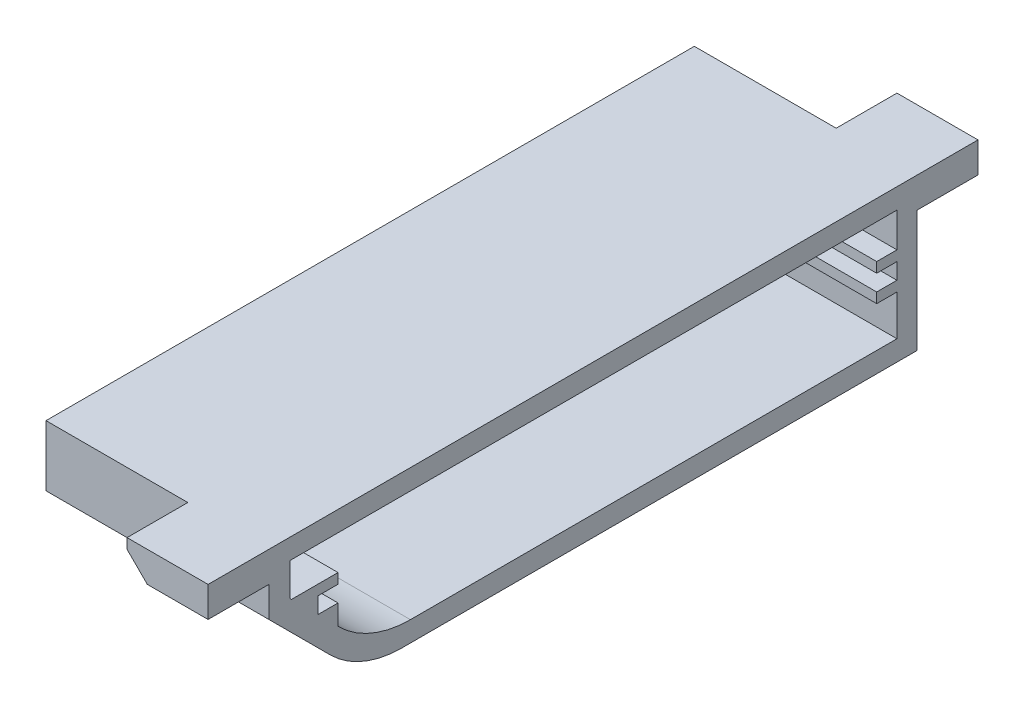
ISO-10303-21;
HEADER;
FILE_DESCRIPTION(('STEP AP214'),'2;1');
FILE_NAME('part.step','',(''),(''),'','','');
FILE_SCHEMA(('AUTOMOTIVE_DESIGN { 1 0 10303 214 1 1 1 1 }'));
ENDSEC;
DATA;
#1=APPLICATION_CONTEXT('core data for automotive mechanical design processes');
#2=APPLICATION_PROTOCOL_DEFINITION('international standard','automotive_design',2000,#1);
#3=PRODUCT_CONTEXT('',#1,'mechanical');
#4=PRODUCT('Part','Part','',(#3));
#5=PRODUCT_RELATED_PRODUCT_CATEGORY('part','',(#4));
#6=PRODUCT_DEFINITION_FORMATION('','',#4);
#7=PRODUCT_DEFINITION_CONTEXT('part definition',#1,'design');
#8=PRODUCT_DEFINITION('design','',#6,#7);
#9=PRODUCT_DEFINITION_SHAPE('','',#8);
#10=(LENGTH_UNIT() NAMED_UNIT(*) SI_UNIT(.MILLI.,.METRE.));
#11=(NAMED_UNIT(*) PLANE_ANGLE_UNIT() SI_UNIT($,.RADIAN.));
#12=(NAMED_UNIT(*) SI_UNIT($,.STERADIAN.) SOLID_ANGLE_UNIT());
#13=UNCERTAINTY_MEASURE_WITH_UNIT(LENGTH_MEASURE(1.E-05),#10,'distance_accuracy_value','');
#14=(GEOMETRIC_REPRESENTATION_CONTEXT(3) GLOBAL_UNCERTAINTY_ASSIGNED_CONTEXT((#13)) GLOBAL_UNIT_ASSIGNED_CONTEXT((#10,
#11,#12)) REPRESENTATION_CONTEXT('',''));
#15=CARTESIAN_POINT('',(0.,0.,0.));
#16=DIRECTION('',(0.,0.,1.));
#17=DIRECTION('',(1.,0.,0.));
#18=AXIS2_PLACEMENT_3D('',#15,#16,#17);
#19=CARTESIAN_POINT('',(0.,0.,2.));
#20=DIRECTION('',(0.,0.,-1.));
#21=DIRECTION('',(-1.,0.,0.));
#22=AXIS2_PLACEMENT_3D('',#19,#20,#21);
#23=PLANE('',#22);
#24=DIRECTION('',(0.,1.,0.));
#25=VECTOR('',#24,1.);
#26=CARTESIAN_POINT('',(22.,15.,2.));
#27=LINE('',#26,#25);
#28=CARTESIAN_POINT('',(22.,7.,2.));
#29=VERTEX_POINT('',#28);
#30=CARTESIAN_POINT('',(22.,8.6,2.));
#31=VERTEX_POINT('',#30);
#32=EDGE_CURVE('E482',#29,#31,#27,.T.);
#33=ORIENTED_EDGE('',*,*,#32,.T.);
#34=DIRECTION('',(-1.,0.,0.));
#35=VECTOR('',#34,1.);
#36=CARTESIAN_POINT('',(22.,8.6,2.));
#37=LINE('',#36,#35);
#38=CARTESIAN_POINT('',(0.,8.6,2.));
#39=VERTEX_POINT('',#38);
#40=EDGE_CURVE('E291',#31,#39,#37,.T.);
#41=ORIENTED_EDGE('',*,*,#40,.T.);
#42=DIRECTION('',(0.,-1.,0.));
#43=VECTOR('',#42,1.);
#44=CARTESIAN_POINT('',(0.,0.,2.));
#45=LINE('',#44,#43);
#46=CARTESIAN_POINT('',(0.,7.,2.));
#47=VERTEX_POINT('',#46);
#48=EDGE_CURVE('E477',#39,#47,#45,.T.);
#49=ORIENTED_EDGE('',*,*,#48,.T.);
#50=DIRECTION('',(-1.,0.,0.));
#51=VECTOR('',#50,1.);
#52=CARTESIAN_POINT('',(22.,7.,2.));
#53=LINE('',#52,#51);
#54=EDGE_CURVE('E325',#29,#47,#53,.T.);
#55=ORIENTED_EDGE('',*,*,#54,.F.);
#56=EDGE_LOOP('',(#33,#41,#49,#55));
#57=FACE_BOUND('',#56,.T.);
#58=ADVANCED_FACE('F39',(#57),#23,.F.);
#59=CARTESIAN_POINT('',(0.,13.,2.));
#60=VERTEX_POINT('',#59);
#61=CARTESIAN_POINT('',(0.,9.6,2.));
#62=VERTEX_POINT('',#61);
#63=EDGE_CURVE('E474',#60,#62,#45,.T.);
#64=ORIENTED_EDGE('',*,*,#63,.T.);
#65=DIRECTION('',(-1.,0.,0.));
#66=VECTOR('',#65,1.);
#67=CARTESIAN_POINT('',(22.,9.6,2.));
#68=LINE('',#67,#66);
#69=CARTESIAN_POINT('',(22.,9.6,2.));
#70=VERTEX_POINT('',#69);
#71=EDGE_CURVE('E303',#70,#62,#68,.T.);
#72=ORIENTED_EDGE('',*,*,#71,.F.);
#73=CARTESIAN_POINT('',(22.,13.,2.));
#74=VERTEX_POINT('',#73);
#75=EDGE_CURVE('E476',#70,#74,#27,.T.);
#76=ORIENTED_EDGE('',*,*,#75,.T.);
#77=DIRECTION('',(1.,0.,0.));
#78=VECTOR('',#77,1.);
#79=CARTESIAN_POINT('',(0.,13.,2.));
#80=LINE('',#79,#78);
#81=EDGE_CURVE('E455',#60,#74,#80,.T.);
#82=ORIENTED_EDGE('',*,*,#81,.F.);
#83=EDGE_LOOP('',(#64,#72,#76,#82));
#84=FACE_BOUND('',#83,.T.);
#85=ADVANCED_FACE('F589',(#84),#23,.F.);
#86=CARTESIAN_POINT('',(22.,-26.085786437627,26.0857864376276));
#87=DIRECTION('',(0.,0.70710678118654,-0.707106781186555));
#88=DIRECTION('',(0.,0.707106781186555,0.70710678118654));
#89=AXIS2_PLACEMENT_3D('',#86,#87,#88);
#90=PLANE('',#89);
#91=DIRECTION('',(0.,-0.707106781186555,-0.70710678118654));
#92=VECTOR('',#91,1.);
#93=CARTESIAN_POINT('',(22.,-26.085786437627,26.0857864376276));
#94=LINE('',#93,#92);
#95=CARTESIAN_POINT('',(22.,4.99999999999995,57.1715728752539));
#96=VERTEX_POINT('',#95);
#97=CARTESIAN_POINT('',(22.,4.92893218813461,57.1005050633885));
#98=VERTEX_POINT('',#97);
#99=EDGE_CURVE('E431',#96,#98,#94,.T.);
#100=ORIENTED_EDGE('',*,*,#99,.T.);
#101=DIRECTION('',(-1.,0.,0.));
#102=VECTOR('',#101,1.);
#103=CARTESIAN_POINT('',(22.,4.9289321881346,57.1005050633885));
#104=LINE('',#103,#102);
#105=CARTESIAN_POINT('',(0.,4.92893218813461,57.1005050633885));
#106=VERTEX_POINT('',#105);
#107=EDGE_CURVE('E519',#98,#106,#104,.T.);
#108=ORIENTED_EDGE('',*,*,#107,.T.);
#109=DIRECTION('',(0.,-0.707106781186555,-0.70710678118654));
#110=VECTOR('',#109,1.);
#111=CARTESIAN_POINT('',(0.,-26.085786437627,26.0857864376276));
#112=LINE('',#111,#110);
#113=CARTESIAN_POINT('',(0.,4.99999999999995,57.1715728752538));
#114=VERTEX_POINT('',#113);
#115=EDGE_CURVE('E426',#114,#106,#112,.T.);
#116=ORIENTED_EDGE('',*,*,#115,.F.);
#117=DIRECTION('',(-1.,0.,0.));
#118=VECTOR('',#117,1.);
#119=CARTESIAN_POINT('',(22.,4.99999999999995,57.1715728752539));
#120=LINE('',#119,#118);
#121=EDGE_CURVE('E368',#96,#114,#120,.T.);
#122=ORIENTED_EDGE('',*,*,#121,.F.);
#123=EDGE_LOOP('',(#100,#108,#116,#122));
#124=FACE_BOUND('',#123,.T.);
#125=ADVANCED_FACE('F551',(#124),#90,.T.);
#126=CARTESIAN_POINT('',(22.,0.,64.));
#127=DIRECTION('',(0.,0.,-1.));
#128=DIRECTION('',(-1.,0.,0.));
#129=AXIS2_PLACEMENT_3D('',#126,#127,#128);
#130=PLANE('',#129);
#131=DIRECTION('',(1.,0.,0.));
#132=VECTOR('',#131,1.);
#133=CARTESIAN_POINT('',(22.,12.,64.));
#134=LINE('',#133,#132);
#135=CARTESIAN_POINT('',(16.,12.,64.));
#136=VERTEX_POINT('',#135);
#137=CARTESIAN_POINT('',(22.,12.,64.));
#138=VERTEX_POINT('',#137);
#139=EDGE_CURVE('E410',#136,#138,#134,.T.);
#140=ORIENTED_EDGE('',*,*,#139,.F.);
#141=DIRECTION('',(0.707106781186546,-0.707106781186549,0.));
#142=VECTOR('',#141,1.);
#143=CARTESIAN_POINT('',(25.,2.99999999999999,64.));
#144=LINE('',#143,#142);
#145=CARTESIAN_POINT('',(14.,14.,64.));
#146=VERTEX_POINT('',#145);
#147=EDGE_CURVE('E517',#136,#146,#144,.F.);
#148=ORIENTED_EDGE('',*,*,#147,.T.);
#149=DIRECTION('',(0.,-1.,0.));
#150=VECTOR('',#149,1.);
#151=CARTESIAN_POINT('',(14.,15.,64.));
#152=LINE('',#151,#150);
#153=CARTESIAN_POINT('',(14.,15.,64.));
#154=VERTEX_POINT('',#153);
#155=EDGE_CURVE('E405',#154,#146,#152,.T.);
#156=ORIENTED_EDGE('',*,*,#155,.F.);
#157=DIRECTION('',(-1.,0.,0.));
#158=VECTOR('',#157,1.);
#159=CARTESIAN_POINT('',(22.,15.,64.));
#160=LINE('',#159,#158);
#161=CARTESIAN_POINT('',(0.,15.,64.));
#162=VERTEX_POINT('',#161);
#163=EDGE_CURVE('E459',#154,#162,#160,.T.);
#164=ORIENTED_EDGE('',*,*,#163,.T.);
#165=DIRECTION('',(0.,-1.,0.));
#166=VECTOR('',#165,1.);
#167=CARTESIAN_POINT('',(0.,0.,64.));
#168=LINE('',#167,#166);
#169=CARTESIAN_POINT('',(0.,9.00000000000001,64.));
#170=VERTEX_POINT('',#169);
#171=EDGE_CURVE('E446',#162,#170,#168,.T.);
#172=ORIENTED_EDGE('',*,*,#171,.T.);
#173=DIRECTION('',(-1.,0.,0.));
#174=VECTOR('',#173,1.);
#175=CARTESIAN_POINT('',(22.,9.00000000000001,64.));
#176=LINE('',#175,#174);
#177=CARTESIAN_POINT('',(22.,9.00000000000001,64.));
#178=VERTEX_POINT('',#177);
#179=EDGE_CURVE('E440',#178,#170,#176,.T.);
#180=ORIENTED_EDGE('',*,*,#179,.F.);
#181=DIRECTION('',(0.,-1.,0.));
#182=VECTOR('',#181,1.);
#183=CARTESIAN_POINT('',(22.,0.,64.));
#184=LINE('',#183,#182);
#185=EDGE_CURVE('E433',#138,#178,#184,.T.);
#186=ORIENTED_EDGE('',*,*,#185,.F.);
#187=EDGE_LOOP('',(#140,#148,#156,#164,#172,#180,#186));
#188=FACE_BOUND('',#187,.T.);
#189=ADVANCED_FACE('F619',(#188),#130,.F.);
#190=CARTESIAN_POINT('',(22.,2.,2.));
#191=VERTEX_POINT('',#190);
#192=CARTESIAN_POINT('',(22.,6.,2.));
#193=VERTEX_POINT('',#192);
#194=EDGE_CURVE('E479',#191,#193,#27,.T.);
#195=ORIENTED_EDGE('',*,*,#194,.T.);
#196=DIRECTION('',(-1.,0.,0.));
#197=VECTOR('',#196,1.);
#198=CARTESIAN_POINT('',(22.,6.,2.));
#199=LINE('',#198,#197);
#200=CARTESIAN_POINT('',(0.,6.,2.));
#201=VERTEX_POINT('',#200);
#202=EDGE_CURVE('E317',#193,#201,#199,.T.);
#203=ORIENTED_EDGE('',*,*,#202,.T.);
#204=CARTESIAN_POINT('',(0.,2.,2.));
#205=VERTEX_POINT('',#204);
#206=EDGE_CURVE('E478',#201,#205,#45,.T.);
#207=ORIENTED_EDGE('',*,*,#206,.T.);
#208=DIRECTION('',(-1.,0.,0.));
#209=VECTOR('',#208,1.);
#210=CARTESIAN_POINT('',(0.,2.,2.));
#211=LINE('',#210,#209);
#212=EDGE_CURVE('E470',#191,#205,#211,.T.);
#213=ORIENTED_EDGE('',*,*,#212,.F.);
#214=EDGE_LOOP('',(#195,#203,#207,#213));
#215=FACE_BOUND('',#214,.T.);
#216=ADVANCED_FACE('F598',(#215),#23,.F.);
#217=CARTESIAN_POINT('',(0.,0.,2.));
#218=DIRECTION('',(1.,0.,0.));
#219=DIRECTION('',(0.,0.,-1.));
#220=AXIS2_PLACEMENT_3D('',#217,#218,#219);
#221=PLANE('',#220);
#222=CARTESIAN_POINT('',(0.,9.76039821620546,61.9319710914593));
#223=VERTEX_POINT('',#222);
#224=CARTESIAN_POINT('',(0.,9.6,61.7715728752538));
#225=VERTEX_POINT('',#224);
#226=EDGE_CURVE('E441',#223,#225,#112,.T.);
#227=ORIENTED_EDGE('',*,*,#226,.T.);
#228=DIRECTION('',(0.,0.,-1.));
#229=VECTOR('',#228,1.);
#230=CARTESIAN_POINT('',(0.,9.6,57.1715728752539));
#231=LINE('',#230,#229);
#232=CARTESIAN_POINT('',(0.,9.6,57.1715728752539));
#233=VERTEX_POINT('',#232);
#234=EDGE_CURVE('E328',#225,#233,#231,.T.);
#235=ORIENTED_EDGE('',*,*,#234,.T.);
#236=DIRECTION('',(0.,-1.,0.));
#237=VECTOR('',#236,1.);
#238=CARTESIAN_POINT('',(0.,8.6,57.1715728752539));
#239=LINE('',#238,#237);
#240=CARTESIAN_POINT('',(0.,8.6,57.1715728752539));
#241=VERTEX_POINT('',#240);
#242=EDGE_CURVE('E355',#233,#241,#239,.T.);
#243=ORIENTED_EDGE('',*,*,#242,.T.);
#244=DIRECTION('',(0.,0.,1.));
#245=VECTOR('',#244,1.);
#246=CARTESIAN_POINT('',(0.,8.6,59.1715728752539));
#247=LINE('',#246,#245);
#248=CARTESIAN_POINT('',(0.,8.6,59.1715728752539));
#249=VERTEX_POINT('',#248);
#250=EDGE_CURVE('E358',#241,#249,#247,.T.);
#251=ORIENTED_EDGE('',*,*,#250,.T.);
#252=DIRECTION('',(0.,-1.,0.));
#253=VECTOR('',#252,1.);
#254=CARTESIAN_POINT('',(0.,7.,59.1715728752539));
#255=LINE('',#254,#253);
#256=CARTESIAN_POINT('',(0.,7.,59.1715728752539));
#257=VERTEX_POINT('',#256);
#258=EDGE_CURVE('E361',#249,#257,#255,.T.);
#259=ORIENTED_EDGE('',*,*,#258,.T.);
#260=DIRECTION('',(0.,0.,-1.));
#261=VECTOR('',#260,1.);
#262=CARTESIAN_POINT('',(0.,7.,57.1715728752539));
#263=LINE('',#262,#261);
#264=CARTESIAN_POINT('',(0.,7.,57.1715728752539));
#265=VERTEX_POINT('',#264);
#266=EDGE_CURVE('E364',#257,#265,#263,.T.);
#267=ORIENTED_EDGE('',*,*,#266,.T.);
#268=DIRECTION('',(0.,-1.,0.));
#269=VECTOR('',#268,1.);
#270=CARTESIAN_POINT('',(0.,7.,57.1715728752539));
#271=LINE('',#270,#269);
#272=EDGE_CURVE('E338',#265,#114,#271,.T.);
#273=ORIENTED_EDGE('',*,*,#272,.T.);
#274=ORIENTED_EDGE('',*,*,#115,.T.);
#275=CARTESIAN_POINT('',(0.,12.,50.0294372515229));
#276=DIRECTION('',(1.,0.,0.));
#277=DIRECTION('',(0.,0.,-1.));
#278=AXIS2_PLACEMENT_3D('',#275,#276,#277);
#279=CIRCLE('',#278,10.);
#280=CARTESIAN_POINT('',(0.,2.,50.0294372515229));
#281=VERTEX_POINT('',#280);
#282=EDGE_CURVE('E47',#106,#281,#279,.T.);
#283=ORIENTED_EDGE('',*,*,#282,.T.);
#284=DIRECTION('',(0.,0.,-1.));
#285=VECTOR('',#284,1.);
#286=CARTESIAN_POINT('',(0.,2.,0.));
#287=LINE('',#286,#285);
#288=EDGE_CURVE('E468',#281,#205,#287,.T.);
#289=ORIENTED_EDGE('',*,*,#288,.T.);
#290=ORIENTED_EDGE('',*,*,#206,.F.);
#291=DIRECTION('',(0.,0.,1.));
#292=VECTOR('',#291,1.);
#293=CARTESIAN_POINT('',(0.,6.,2.));
#294=LINE('',#293,#292);
#295=CARTESIAN_POINT('',(0.,6.,4.));
#296=VERTEX_POINT('',#295);
#297=EDGE_CURVE('E302',#201,#296,#294,.T.);
#298=ORIENTED_EDGE('',*,*,#297,.T.);
#299=DIRECTION('',(0.,1.,0.));
#300=VECTOR('',#299,1.);
#301=CARTESIAN_POINT('',(0.,6.,4.));
#302=LINE('',#301,#300);
#303=CARTESIAN_POINT('',(0.,7.,4.));
#304=VERTEX_POINT('',#303);
#305=EDGE_CURVE('E320',#296,#304,#302,.T.);
#306=ORIENTED_EDGE('',*,*,#305,.T.);
#307=DIRECTION('',(0.,0.,-1.));
#308=VECTOR('',#307,1.);
#309=CARTESIAN_POINT('',(0.,7.,4.));
#310=LINE('',#309,#308);
#311=EDGE_CURVE('E311',#304,#47,#310,.T.);
#312=ORIENTED_EDGE('',*,*,#311,.T.);
#313=ORIENTED_EDGE('',*,*,#48,.F.);
#314=DIRECTION('',(0.,0.,1.));
#315=VECTOR('',#314,1.);
#316=CARTESIAN_POINT('',(0.,8.6,2.));
#317=LINE('',#316,#315);
#318=CARTESIAN_POINT('',(0.,8.6,4.));
#319=VERTEX_POINT('',#318);
#320=EDGE_CURVE('E298',#39,#319,#317,.T.);
#321=ORIENTED_EDGE('',*,*,#320,.T.);
#322=DIRECTION('',(0.,1.,0.));
#323=VECTOR('',#322,1.);
#324=CARTESIAN_POINT('',(0.,8.6,4.));
#325=LINE('',#324,#323);
#326=CARTESIAN_POINT('',(0.,9.6,4.));
#327=VERTEX_POINT('',#326);
#328=EDGE_CURVE('E272',#319,#327,#325,.T.);
#329=ORIENTED_EDGE('',*,*,#328,.T.);
#330=DIRECTION('',(0.,0.,-1.));
#331=VECTOR('',#330,1.);
#332=CARTESIAN_POINT('',(0.,9.6,4.));
#333=LINE('',#332,#331);
#334=EDGE_CURVE('E292',#327,#62,#333,.T.);
#335=ORIENTED_EDGE('',*,*,#334,.T.);
#336=ORIENTED_EDGE('',*,*,#63,.F.);
#337=DIRECTION('',(0.,0.,-1.));
#338=VECTOR('',#337,1.);
#339=CARTESIAN_POINT('',(0.,13.,0.));
#340=LINE('',#339,#338);
#341=CARTESIAN_POINT('',(0.,13.,61.9319710914593));
#342=VERTEX_POINT('',#341);
#343=EDGE_CURVE('E448',#342,#60,#340,.T.);
#344=ORIENTED_EDGE('',*,*,#343,.F.);
#345=DIRECTION('',(0.,1.,0.));
#346=VECTOR('',#345,1.);
#347=CARTESIAN_POINT('',(0.,0.,61.9319710914593));
#348=LINE('',#347,#346);
#349=EDGE_CURVE('E451',#223,#342,#348,.T.);
#350=ORIENTED_EDGE('',*,*,#349,.F.);
#351=EDGE_LOOP('',(#227,#235,#243,#251,#259,#267,#273,#274,#283,#289,#290,#298,#306,#312,#313,
#321,#329,#335,#336,#344,#350));
#352=FACE_BOUND('',#351,.T.);
#353=DIRECTION('',(0.,0.,-1.));
#354=VECTOR('',#353,1.);
#355=CARTESIAN_POINT('',(0.,0.,2.));
#356=LINE('',#355,#354);
#357=CARTESIAN_POINT('',(0.,0.,50.8578643762692));
#358=VERTEX_POINT('',#357);
#359=CARTESIAN_POINT('',(0.,0.,0.));
#360=VERTEX_POINT('',#359);
#361=EDGE_CURVE('E499',#358,#360,#356,.T.);
#362=ORIENTED_EDGE('',*,*,#361,.F.);
#363=CARTESIAN_POINT('',(0.,10.,50.8578643762692));
#364=DIRECTION('',(1.,0.,0.));
#365=DIRECTION('',(0.,0.,-1.));
#366=AXIS2_PLACEMENT_3D('',#363,#364,#365);
#367=CIRCLE('',#366,10.);
#368=CARTESIAN_POINT('',(0.,2.9289321881346,57.9289321881347));
#369=VERTEX_POINT('',#368);
#370=EDGE_CURVE('E62',#358,#369,#367,.F.);
#371=ORIENTED_EDGE('',*,*,#370,.T.);
#372=DIRECTION('',(0.,-0.707106781186554,-0.707106781186542));
#373=VECTOR('',#372,1.);
#374=CARTESIAN_POINT('',(0.,-27.5000000000001,27.5000000000005));
#375=LINE('',#374,#373);
#376=EDGE_CURVE('E444',#170,#369,#375,.T.);
#377=ORIENTED_EDGE('',*,*,#376,.F.);
#378=ORIENTED_EDGE('',*,*,#171,.F.);
#379=DIRECTION('',(0.,0.,-1.));
#380=VECTOR('',#379,1.);
#381=CARTESIAN_POINT('',(0.,15.,2.));
#382=LINE('',#381,#380);
#383=CARTESIAN_POINT('',(0.,15.,0.));
#384=VERTEX_POINT('',#383);
#385=EDGE_CURVE('E481',#162,#384,#382,.T.);
#386=ORIENTED_EDGE('',*,*,#385,.T.);
#387=DIRECTION('',(0.,-1.,0.));
#388=VECTOR('',#387,1.);
#389=CARTESIAN_POINT('',(0.,0.,0.));
#390=LINE('',#389,#388);
#391=EDGE_CURVE('E473',#384,#360,#390,.T.);
#392=ORIENTED_EDGE('',*,*,#391,.T.);
#393=EDGE_LOOP('',(#362,#371,#377,#378,#386,#392));
#394=FACE_BOUND('',#393,.T.);
#395=ADVANCED_FACE('F533',(#352,#394),#221,.F.);
#396=CARTESIAN_POINT('',(0.,0.,2.));
#397=DIRECTION('',(0.,1.,0.));
#398=DIRECTION('',(0.,0.,1.));
#399=AXIS2_PLACEMENT_3D('',#396,#397,#398);
#400=PLANE('',#399);
#401=DIRECTION('',(0.,0.,-1.));
#402=VECTOR('',#401,1.);
#403=CARTESIAN_POINT('',(22.,0.,2.));
#404=LINE('',#403,#402);
#405=CARTESIAN_POINT('',(22.,0.,50.8578643762692));
#406=VERTEX_POINT('',#405);
#407=CARTESIAN_POINT('',(22.,0.,0.));
#408=VERTEX_POINT('',#407);
#409=EDGE_CURVE('E497',#406,#408,#404,.T.);
#410=ORIENTED_EDGE('',*,*,#409,.F.);
#411=DIRECTION('',(-1.,0.,0.));
#412=VECTOR('',#411,1.);
#413=CARTESIAN_POINT('',(0.,0.,50.8578643762692));
#414=LINE('',#413,#412);
#415=EDGE_CURVE('E524',#406,#358,#414,.T.);
#416=ORIENTED_EDGE('',*,*,#415,.T.);
#417=ORIENTED_EDGE('',*,*,#361,.T.);
#418=DIRECTION('',(1.,0.,0.));
#419=VECTOR('',#418,1.);
#420=CARTESIAN_POINT('',(0.,0.,0.));
#421=LINE('',#420,#419);
#422=EDGE_CURVE('E485',#360,#408,#421,.T.);
#423=ORIENTED_EDGE('',*,*,#422,.T.);
#424=EDGE_LOOP('',(#410,#416,#417,#423));
#425=FACE_BOUND('',#424,.T.);
#426=ADVANCED_FACE('F624',(#425),#400,.F.);
#427=CARTESIAN_POINT('',(22.,15.,2.));
#428=DIRECTION('',(-1.,0.,0.));
#429=DIRECTION('',(0.,-1.,0.));
#430=AXIS2_PLACEMENT_3D('',#427,#428,#429);
#431=PLANE('',#430);
#432=DIRECTION('',(0.,0.,-1.));
#433=VECTOR('',#432,1.);
#434=CARTESIAN_POINT('',(22.,9.6,57.1715728752539));
#435=LINE('',#434,#433);
#436=CARTESIAN_POINT('',(22.,9.6,61.7715728752538));
#437=VERTEX_POINT('',#436);
#438=CARTESIAN_POINT('',(22.,9.6,57.1715728752539));
#439=VERTEX_POINT('',#438);
#440=EDGE_CURVE('E334',#437,#439,#435,.T.);
#441=ORIENTED_EDGE('',*,*,#440,.F.);
#442=CARTESIAN_POINT('',(22.,9.76039821620546,61.9319710914593));
#443=VERTEX_POINT('',#442);
#444=EDGE_CURVE('E427',#443,#437,#94,.T.);
#445=ORIENTED_EDGE('',*,*,#444,.F.);
#446=DIRECTION('',(0.,1.,0.));
#447=VECTOR('',#446,1.);
#448=CARTESIAN_POINT('',(22.,0.,61.9319710914593));
#449=LINE('',#448,#447);
#450=CARTESIAN_POINT('',(22.,13.,61.9319710914593));
#451=VERTEX_POINT('',#450);
#452=EDGE_CURVE('E438',#443,#451,#449,.T.);
#453=ORIENTED_EDGE('',*,*,#452,.T.);
#454=DIRECTION('',(0.,0.,-1.));
#455=VECTOR('',#454,1.);
#456=CARTESIAN_POINT('',(22.,13.,0.));
#457=LINE('',#456,#455);
#458=EDGE_CURVE('E435',#451,#74,#457,.T.);
#459=ORIENTED_EDGE('',*,*,#458,.T.);
#460=ORIENTED_EDGE('',*,*,#75,.F.);
#461=DIRECTION('',(0.,0.,-1.));
#462=VECTOR('',#461,1.);
#463=CARTESIAN_POINT('',(22.,9.6,4.));
#464=LINE('',#463,#462);
#465=CARTESIAN_POINT('',(22.,9.6,4.));
#466=VERTEX_POINT('',#465);
#467=EDGE_CURVE('E278',#466,#70,#464,.T.);
#468=ORIENTED_EDGE('',*,*,#467,.F.);
#469=DIRECTION('',(0.,1.,0.));
#470=VECTOR('',#469,1.);
#471=CARTESIAN_POINT('',(22.,8.6,4.));
#472=LINE('',#471,#470);
#473=CARTESIAN_POINT('',(22.,8.6,4.));
#474=VERTEX_POINT('',#473);
#475=EDGE_CURVE('E270',#474,#466,#472,.T.);
#476=ORIENTED_EDGE('',*,*,#475,.F.);
#477=DIRECTION('',(0.,0.,1.));
#478=VECTOR('',#477,1.);
#479=CARTESIAN_POINT('',(22.,8.6,2.));
#480=LINE('',#479,#478);
#481=EDGE_CURVE('E286',#31,#474,#480,.T.);
#482=ORIENTED_EDGE('',*,*,#481,.F.);
#483=ORIENTED_EDGE('',*,*,#32,.F.);
#484=DIRECTION('',(0.,0.,-1.));
#485=VECTOR('',#484,1.);
#486=CARTESIAN_POINT('',(22.,7.,4.));
#487=LINE('',#486,#485);
#488=CARTESIAN_POINT('',(22.,7.,4.));
#489=VERTEX_POINT('',#488);
#490=EDGE_CURVE('E314',#489,#29,#487,.T.);
#491=ORIENTED_EDGE('',*,*,#490,.F.);
#492=DIRECTION('',(0.,1.,0.));
#493=VECTOR('',#492,1.);
#494=CARTESIAN_POINT('',(22.,6.,4.));
#495=LINE('',#494,#493);
#496=CARTESIAN_POINT('',(22.,6.,4.));
#497=VERTEX_POINT('',#496);
#498=EDGE_CURVE('E310',#497,#489,#495,.T.);
#499=ORIENTED_EDGE('',*,*,#498,.F.);
#500=DIRECTION('',(0.,0.,1.));
#501=VECTOR('',#500,1.);
#502=CARTESIAN_POINT('',(22.,6.,2.));
#503=LINE('',#502,#501);
#504=EDGE_CURVE('E307',#193,#497,#503,.T.);
#505=ORIENTED_EDGE('',*,*,#504,.F.);
#506=ORIENTED_EDGE('',*,*,#194,.F.);
#507=DIRECTION('',(0.,0.,1.));
#508=VECTOR('',#507,1.);
#509=CARTESIAN_POINT('',(22.,2.,0.));
#510=LINE('',#509,#508);
#511=CARTESIAN_POINT('',(22.,2.,50.0294372515229));
#512=VERTEX_POINT('',#511);
#513=EDGE_CURVE('E465',#191,#512,#510,.T.);
#514=ORIENTED_EDGE('',*,*,#513,.T.);
#515=CARTESIAN_POINT('',(22.,12.,50.0294372515229));
#516=DIRECTION('',(-1.,0.,0.));
#517=DIRECTION('',(0.,-1.,0.));
#518=AXIS2_PLACEMENT_3D('',#515,#516,#517);
#519=CIRCLE('',#518,10.);
#520=EDGE_CURVE('E11',#512,#98,#519,.T.);
#521=ORIENTED_EDGE('',*,*,#520,.T.);
#522=ORIENTED_EDGE('',*,*,#99,.F.);
#523=DIRECTION('',(0.,-1.,0.));
#524=VECTOR('',#523,1.);
#525=CARTESIAN_POINT('',(22.,7.,57.1715728752539));
#526=LINE('',#525,#524);
#527=CARTESIAN_POINT('',(22.,7.,57.1715728752539));
#528=VERTEX_POINT('',#527);
#529=EDGE_CURVE('E350',#528,#96,#526,.T.);
#530=ORIENTED_EDGE('',*,*,#529,.F.);
#531=DIRECTION('',(0.,0.,-1.));
#532=VECTOR('',#531,1.);
#533=CARTESIAN_POINT('',(22.,7.,57.1715728752539));
#534=LINE('',#533,#532);
#535=CARTESIAN_POINT('',(22.,7.,59.1715728752539));
#536=VERTEX_POINT('',#535);
#537=EDGE_CURVE('E347',#536,#528,#534,.T.);
#538=ORIENTED_EDGE('',*,*,#537,.F.);
#539=DIRECTION('',(0.,-1.,0.));
#540=VECTOR('',#539,1.);
#541=CARTESIAN_POINT('',(22.,7.,59.1715728752539));
#542=LINE('',#541,#540);
#543=CARTESIAN_POINT('',(22.,8.6,59.1715728752539));
#544=VERTEX_POINT('',#543);
#545=EDGE_CURVE('E344',#544,#536,#542,.T.);
#546=ORIENTED_EDGE('',*,*,#545,.F.);
#547=DIRECTION('',(0.,0.,1.));
#548=VECTOR('',#547,1.);
#549=CARTESIAN_POINT('',(22.,8.6,59.1715728752539));
#550=LINE('',#549,#548);
#551=CARTESIAN_POINT('',(22.,8.6,57.1715728752539));
#552=VERTEX_POINT('',#551);
#553=EDGE_CURVE('E341',#552,#544,#550,.T.);
#554=ORIENTED_EDGE('',*,*,#553,.F.);
#555=DIRECTION('',(0.,-1.,0.));
#556=VECTOR('',#555,1.);
#557=CARTESIAN_POINT('',(22.,8.6,57.1715728752539));
#558=LINE('',#557,#556);
#559=EDGE_CURVE('E337',#439,#552,#558,.T.);
#560=ORIENTED_EDGE('',*,*,#559,.F.);
#561=EDGE_LOOP('',(#441,#445,#453,#459,#460,#468,#476,#482,#483,#491,#499,#505,#506,#514,#521,
#522,#530,#538,#546,#554,#560));
#562=FACE_BOUND('',#561,.T.);
#563=DIRECTION('',(0.,-0.707106781186554,-0.707106781186542));
#564=VECTOR('',#563,1.);
#565=CARTESIAN_POINT('',(22.,-27.5000000000001,27.5000000000005));
#566=LINE('',#565,#564);
#567=CARTESIAN_POINT('',(22.,2.9289321881346,57.9289321881347));
#568=VERTEX_POINT('',#567);
#569=EDGE_CURVE('E430',#178,#568,#566,.T.);
#570=ORIENTED_EDGE('',*,*,#569,.T.);
#571=CARTESIAN_POINT('',(22.,10.,50.8578643762692));
#572=DIRECTION('',(-1.,0.,0.));
#573=DIRECTION('',(0.,-1.,0.));
#574=AXIS2_PLACEMENT_3D('',#571,#572,#573);
#575=CIRCLE('',#574,10.);
#576=EDGE_CURVE('E529',#568,#406,#575,.F.);
#577=ORIENTED_EDGE('',*,*,#576,.T.);
#578=ORIENTED_EDGE('',*,*,#409,.T.);
#579=DIRECTION('',(0.,1.,0.));
#580=VECTOR('',#579,1.);
#581=CARTESIAN_POINT('',(22.,15.,0.));
#582=LINE('',#581,#580);
#583=CARTESIAN_POINT('',(22.,12.,0.));
#584=VERTEX_POINT('',#583);
#585=EDGE_CURVE('E488',#408,#584,#582,.T.);
#586=ORIENTED_EDGE('',*,*,#585,.T.);
#587=DIRECTION('',(0.,0.,1.));
#588=VECTOR('',#587,1.);
#589=CARTESIAN_POINT('',(22.,12.,-6.));
#590=LINE('',#589,#588);
#591=CARTESIAN_POINT('',(22.,12.,-6.));
#592=VERTEX_POINT('',#591);
#593=EDGE_CURVE('E402',#592,#584,#590,.T.);
#594=ORIENTED_EDGE('',*,*,#593,.F.);
#595=DIRECTION('',(0.,-1.,0.));
#596=VECTOR('',#595,1.);
#597=CARTESIAN_POINT('',(22.,15.,-6.));
#598=LINE('',#597,#596);
#599=CARTESIAN_POINT('',(22.,15.,-6.));
#600=VERTEX_POINT('',#599);
#601=EDGE_CURVE('E384',#600,#592,#598,.T.);
#602=ORIENTED_EDGE('',*,*,#601,.F.);
#603=DIRECTION('',(0.,0.,-1.));
#604=VECTOR('',#603,1.);
#605=CARTESIAN_POINT('',(22.,15.,2.));
#606=LINE('',#605,#604);
#607=CARTESIAN_POINT('',(22.,15.,70.));
#608=VERTEX_POINT('',#607);
#609=EDGE_CURVE('E495',#608,#600,#606,.T.);
#610=ORIENTED_EDGE('',*,*,#609,.F.);
#611=DIRECTION('',(0.,1.,0.));
#612=VECTOR('',#611,1.);
#613=CARTESIAN_POINT('',(22.,15.,70.));
#614=LINE('',#613,#612);
#615=CARTESIAN_POINT('',(22.,12.,70.));
#616=VERTEX_POINT('',#615);
#617=EDGE_CURVE('E406',#616,#608,#614,.T.);
#618=ORIENTED_EDGE('',*,*,#617,.F.);
#619=DIRECTION('',(0.,0.,-1.));
#620=VECTOR('',#619,1.);
#621=CARTESIAN_POINT('',(22.,12.,70.));
#622=LINE('',#621,#620);
#623=EDGE_CURVE('E417',#616,#138,#622,.T.);
#624=ORIENTED_EDGE('',*,*,#623,.T.);
#625=ORIENTED_EDGE('',*,*,#185,.T.);
#626=EDGE_LOOP('',(#570,#577,#578,#586,#594,#602,#610,#618,#624,#625));
#627=FACE_BOUND('',#626,.T.);
#628=ADVANCED_FACE('F284',(#562,#627),#431,.F.);
#629=CARTESIAN_POINT('',(0.,15.,2.));
#630=DIRECTION('',(0.,-1.,0.));
#631=DIRECTION('',(0.,0.,-1.));
#632=AXIS2_PLACEMENT_3D('',#629,#630,#631);
#633=PLANE('',#632);
#634=ORIENTED_EDGE('',*,*,#609,.T.);
#635=DIRECTION('',(1.,0.,0.));
#636=VECTOR('',#635,1.);
#637=CARTESIAN_POINT('',(22.,15.,-6.));
#638=LINE('',#637,#636);
#639=CARTESIAN_POINT('',(14.,15.,-6.));
#640=VERTEX_POINT('',#639);
#641=EDGE_CURVE('E393',#640,#600,#638,.T.);
#642=ORIENTED_EDGE('',*,*,#641,.F.);
#643=DIRECTION('',(0.,0.,1.));
#644=VECTOR('',#643,1.);
#645=CARTESIAN_POINT('',(14.,15.,-6.));
#646=LINE('',#645,#644);
#647=CARTESIAN_POINT('',(14.,15.,0.));
#648=VERTEX_POINT('',#647);
#649=EDGE_CURVE('E396',#640,#648,#646,.T.);
#650=ORIENTED_EDGE('',*,*,#649,.T.);
#651=DIRECTION('',(-1.,0.,0.));
#652=VECTOR('',#651,1.);
#653=CARTESIAN_POINT('',(0.,15.,0.));
#654=LINE('',#653,#652);
#655=EDGE_CURVE('E491',#648,#384,#654,.T.);
#656=ORIENTED_EDGE('',*,*,#655,.T.);
#657=ORIENTED_EDGE('',*,*,#385,.F.);
#658=ORIENTED_EDGE('',*,*,#163,.F.);
#659=DIRECTION('',(0.,0.,-1.));
#660=VECTOR('',#659,1.);
#661=CARTESIAN_POINT('',(14.,15.,70.));
#662=LINE('',#661,#660);
#663=CARTESIAN_POINT('',(14.,15.,70.));
#664=VERTEX_POINT('',#663);
#665=EDGE_CURVE('E423',#664,#154,#662,.T.);
#666=ORIENTED_EDGE('',*,*,#665,.F.);
#667=DIRECTION('',(-1.,0.,0.));
#668=VECTOR('',#667,1.);
#669=CARTESIAN_POINT('',(22.,15.,70.));
#670=LINE('',#669,#668);
#671=EDGE_CURVE('E409',#608,#664,#670,.T.);
#672=ORIENTED_EDGE('',*,*,#671,.F.);
#673=EDGE_LOOP('',(#634,#642,#650,#656,#657,#658,#666,#672));
#674=FACE_BOUND('',#673,.T.);
#675=ADVANCED_FACE('F646',(#674),#633,.F.);
#676=CARTESIAN_POINT('',(0.,0.,0.));
#677=DIRECTION('',(0.,0.,-1.));
#678=DIRECTION('',(-1.,0.,0.));
#679=AXIS2_PLACEMENT_3D('',#676,#677,#678);
#680=PLANE('',#679);
#681=DIRECTION('',(0.,1.,0.));
#682=VECTOR('',#681,1.);
#683=CARTESIAN_POINT('',(14.,15.,0.));
#684=LINE('',#683,#682);
#685=CARTESIAN_POINT('',(14.,14.,0.));
#686=VERTEX_POINT('',#685);
#687=EDGE_CURVE('E388',#686,#648,#684,.T.);
#688=ORIENTED_EDGE('',*,*,#687,.F.);
#689=DIRECTION('',(-0.707106781186548,0.707106781186548,0.));
#690=VECTOR('',#689,1.);
#691=CARTESIAN_POINT('',(14.,14.,0.));
#692=LINE('',#691,#690);
#693=CARTESIAN_POINT('',(16.,12.,0.));
#694=VERTEX_POINT('',#693);
#695=EDGE_CURVE('E515',#686,#694,#692,.F.);
#696=ORIENTED_EDGE('',*,*,#695,.T.);
#697=DIRECTION('',(-1.,0.,0.));
#698=VECTOR('',#697,1.);
#699=CARTESIAN_POINT('',(22.,12.,0.));
#700=LINE('',#699,#698);
#701=EDGE_CURVE('E371',#584,#694,#700,.T.);
#702=ORIENTED_EDGE('',*,*,#701,.F.);
#703=ORIENTED_EDGE('',*,*,#585,.F.);
#704=ORIENTED_EDGE('',*,*,#422,.F.);
#705=ORIENTED_EDGE('',*,*,#391,.F.);
#706=ORIENTED_EDGE('',*,*,#655,.F.);
#707=EDGE_LOOP('',(#688,#696,#702,#703,#704,#705,#706));
#708=FACE_BOUND('',#707,.T.);
#709=ADVANCED_FACE('F641',(#708),#680,.T.);
#710=CARTESIAN_POINT('',(0.,2.,0.));
#711=DIRECTION('',(0.,-1.,0.));
#712=DIRECTION('',(0.,0.,-1.));
#713=AXIS2_PLACEMENT_3D('',#710,#711,#712);
#714=PLANE('',#713);
#715=ORIENTED_EDGE('',*,*,#288,.F.);
#716=DIRECTION('',(-1.,0.,0.));
#717=VECTOR('',#716,1.);
#718=CARTESIAN_POINT('',(0.,2.,50.0294372515229));
#719=LINE('',#718,#717);
#720=EDGE_CURVE('E522',#281,#512,#719,.F.);
#721=ORIENTED_EDGE('',*,*,#720,.T.);
#722=ORIENTED_EDGE('',*,*,#513,.F.);
#723=ORIENTED_EDGE('',*,*,#212,.T.);
#724=EDGE_LOOP('',(#715,#721,#722,#723));
#725=FACE_BOUND('',#724,.T.);
#726=ADVANCED_FACE('F541',(#725),#714,.F.);
#727=CARTESIAN_POINT('',(22.,13.,0.));
#728=DIRECTION('',(0.,1.,0.));
#729=DIRECTION('',(0.,0.,1.));
#730=AXIS2_PLACEMENT_3D('',#727,#728,#729);
#731=PLANE('',#730);
#732=ORIENTED_EDGE('',*,*,#343,.T.);
#733=ORIENTED_EDGE('',*,*,#81,.T.);
#734=ORIENTED_EDGE('',*,*,#458,.F.);
#735=DIRECTION('',(-1.,0.,0.));
#736=VECTOR('',#735,1.);
#737=CARTESIAN_POINT('',(22.,13.,61.9319710914593));
#738=LINE('',#737,#736);
#739=EDGE_CURVE('E456',#451,#342,#738,.T.);
#740=ORIENTED_EDGE('',*,*,#739,.T.);
#741=EDGE_LOOP('',(#732,#733,#734,#740));
#742=FACE_BOUND('',#741,.T.);
#743=ADVANCED_FACE('F585',(#742),#731,.F.);
#744=DIRECTION('',(-1.,0.,0.));
#745=VECTOR('',#744,1.);
#746=CARTESIAN_POINT('',(22.,9.6,61.7715728752538));
#747=LINE('',#746,#745);
#748=EDGE_CURVE('E352',#437,#225,#747,.T.);
#749=ORIENTED_EDGE('',*,*,#748,.T.);
#750=ORIENTED_EDGE('',*,*,#226,.F.);
#751=DIRECTION('',(-1.,0.,0.));
#752=VECTOR('',#751,1.);
#753=CARTESIAN_POINT('',(22.,9.76039821620546,61.9319710914593));
#754=LINE('',#753,#752);
#755=EDGE_CURVE('E453',#443,#223,#754,.T.);
#756=ORIENTED_EDGE('',*,*,#755,.F.);
#757=ORIENTED_EDGE('',*,*,#444,.T.);
#758=EDGE_LOOP('',(#749,#750,#756,#757));
#759=FACE_BOUND('',#758,.T.);
#760=ADVANCED_FACE('F576',(#759),#90,.T.);
#761=CARTESIAN_POINT('',(22.,0.,61.9319710914593));
#762=DIRECTION('',(0.,0.,1.));
#763=DIRECTION('',(1.,0.,0.));
#764=AXIS2_PLACEMENT_3D('',#761,#762,#763);
#765=PLANE('',#764);
#766=ORIENTED_EDGE('',*,*,#349,.T.);
#767=ORIENTED_EDGE('',*,*,#739,.F.);
#768=ORIENTED_EDGE('',*,*,#452,.F.);
#769=ORIENTED_EDGE('',*,*,#755,.T.);
#770=EDGE_LOOP('',(#766,#767,#768,#769));
#771=FACE_BOUND('',#770,.T.);
#772=ADVANCED_FACE('F581',(#771),#765,.F.);
#773=CARTESIAN_POINT('',(22.,-27.5000000000001,27.5000000000005));
#774=DIRECTION('',(0.,0.707106781186542,-0.707106781186554));
#775=DIRECTION('',(0.,0.707106781186554,0.707106781186542));
#776=AXIS2_PLACEMENT_3D('',#773,#774,#775);
#777=PLANE('',#776);
#778=ORIENTED_EDGE('',*,*,#376,.T.);
#779=DIRECTION('',(-1.,0.,0.));
#780=VECTOR('',#779,1.);
#781=CARTESIAN_POINT('',(22.,2.92893218813459,57.9289321881347));
#782=LINE('',#781,#780);
#783=EDGE_CURVE('E54',#369,#568,#782,.F.);
#784=ORIENTED_EDGE('',*,*,#783,.T.);
#785=ORIENTED_EDGE('',*,*,#569,.F.);
#786=ORIENTED_EDGE('',*,*,#179,.T.);
#787=EDGE_LOOP('',(#778,#784,#785,#786));
#788=FACE_BOUND('',#787,.T.);
#789=ADVANCED_FACE('F636',(#788),#777,.F.);
#790=CARTESIAN_POINT('',(14.,15.,70.));
#791=DIRECTION('',(1.,0.,0.));
#792=DIRECTION('',(0.,0.,-1.));
#793=AXIS2_PLACEMENT_3D('',#790,#791,#792);
#794=PLANE('',#793);
#795=ORIENTED_EDGE('',*,*,#155,.T.);
#796=DIRECTION('',(0.,0.,1.));
#797=VECTOR('',#796,1.);
#798=CARTESIAN_POINT('',(14.,14.,70.));
#799=LINE('',#798,#797);
#800=CARTESIAN_POINT('',(14.,14.,70.));
#801=VERTEX_POINT('',#800);
#802=EDGE_CURVE('E511',#146,#801,#799,.T.);
#803=ORIENTED_EDGE('',*,*,#802,.T.);
#804=DIRECTION('',(0.,-1.,0.));
#805=VECTOR('',#804,1.);
#806=CARTESIAN_POINT('',(14.,15.,70.));
#807=LINE('',#806,#805);
#808=EDGE_CURVE('E412',#664,#801,#807,.T.);
#809=ORIENTED_EDGE('',*,*,#808,.F.);
#810=ORIENTED_EDGE('',*,*,#665,.T.);
#811=EDGE_LOOP('',(#795,#803,#809,#810));
#812=FACE_BOUND('',#811,.T.);
#813=ADVANCED_FACE('F638',(#812),#794,.F.);
#814=CARTESIAN_POINT('',(22.,12.,70.));
#815=DIRECTION('',(0.,1.,0.));
#816=DIRECTION('',(-1.,0.,0.));
#817=AXIS2_PLACEMENT_3D('',#814,#815,#816);
#818=PLANE('',#817);
#819=DIRECTION('',(1.,0.,0.));
#820=VECTOR('',#819,1.);
#821=CARTESIAN_POINT('',(22.,12.,70.));
#822=LINE('',#821,#820);
#823=CARTESIAN_POINT('',(16.,12.,70.));
#824=VERTEX_POINT('',#823);
#825=EDGE_CURVE('E415',#824,#616,#822,.T.);
#826=ORIENTED_EDGE('',*,*,#825,.F.);
#827=DIRECTION('',(0.,0.,-1.));
#828=VECTOR('',#827,1.);
#829=CARTESIAN_POINT('',(16.,12.,70.));
#830=LINE('',#829,#828);
#831=EDGE_CURVE('E508',#824,#136,#830,.T.);
#832=ORIENTED_EDGE('',*,*,#831,.T.);
#833=ORIENTED_EDGE('',*,*,#139,.T.);
#834=ORIENTED_EDGE('',*,*,#623,.F.);
#835=EDGE_LOOP('',(#826,#832,#833,#834));
#836=FACE_BOUND('',#835,.T.);
#837=ADVANCED_FACE('F720',(#836),#818,.F.);
#838=CARTESIAN_POINT('',(0.,0.,70.));
#839=DIRECTION('',(0.,0.,-1.));
#840=DIRECTION('',(-1.,0.,0.));
#841=AXIS2_PLACEMENT_3D('',#838,#839,#840);
#842=PLANE('',#841);
#843=ORIENTED_EDGE('',*,*,#808,.T.);
#844=DIRECTION('',(-0.707106781186546,0.707106781186549,0.));
#845=VECTOR('',#844,1.);
#846=CARTESIAN_POINT('',(16.,12.,70.));
#847=LINE('',#846,#845);
#848=EDGE_CURVE('E513',#801,#824,#847,.F.);
#849=ORIENTED_EDGE('',*,*,#848,.T.);
#850=ORIENTED_EDGE('',*,*,#825,.T.);
#851=ORIENTED_EDGE('',*,*,#617,.T.);
#852=ORIENTED_EDGE('',*,*,#671,.T.);
#853=EDGE_LOOP('',(#843,#849,#850,#851,#852));
#854=FACE_BOUND('',#853,.T.);
#855=ADVANCED_FACE('F716',(#854),#842,.F.);
#856=CARTESIAN_POINT('',(22.,12.,-6.));
#857=DIRECTION('',(0.,1.,0.));
#858=DIRECTION('',(0.,0.,1.));
#859=AXIS2_PLACEMENT_3D('',#856,#857,#858);
#860=PLANE('',#859);
#861=ORIENTED_EDGE('',*,*,#701,.T.);
#862=DIRECTION('',(0.,0.,-1.));
#863=VECTOR('',#862,1.);
#864=CARTESIAN_POINT('',(16.,12.,-6.));
#865=LINE('',#864,#863);
#866=CARTESIAN_POINT('',(16.,12.,-6.));
#867=VERTEX_POINT('',#866);
#868=EDGE_CURVE('E504',#694,#867,#865,.T.);
#869=ORIENTED_EDGE('',*,*,#868,.T.);
#870=DIRECTION('',(-1.,0.,0.));
#871=VECTOR('',#870,1.);
#872=CARTESIAN_POINT('',(22.,12.,-6.));
#873=LINE('',#872,#871);
#874=EDGE_CURVE('E387',#592,#867,#873,.T.);
#875=ORIENTED_EDGE('',*,*,#874,.F.);
#876=ORIENTED_EDGE('',*,*,#593,.T.);
#877=EDGE_LOOP('',(#861,#869,#875,#876));
#878=FACE_BOUND('',#877,.T.);
#879=ADVANCED_FACE('F712',(#878),#860,.F.);
#880=CARTESIAN_POINT('',(14.,15.,-6.));
#881=DIRECTION('',(1.,0.,0.));
#882=DIRECTION('',(0.,0.,-1.));
#883=AXIS2_PLACEMENT_3D('',#880,#881,#882);
#884=PLANE('',#883);
#885=DIRECTION('',(0.,1.,0.));
#886=VECTOR('',#885,1.);
#887=CARTESIAN_POINT('',(14.,15.,-6.));
#888=LINE('',#887,#886);
#889=CARTESIAN_POINT('',(14.,14.,-6.));
#890=VERTEX_POINT('',#889);
#891=EDGE_CURVE('E391',#890,#640,#888,.T.);
#892=ORIENTED_EDGE('',*,*,#891,.F.);
#893=DIRECTION('',(0.,0.,1.));
#894=VECTOR('',#893,1.);
#895=CARTESIAN_POINT('',(14.,14.,-6.));
#896=LINE('',#895,#894);
#897=EDGE_CURVE('E501',#890,#686,#896,.T.);
#898=ORIENTED_EDGE('',*,*,#897,.T.);
#899=ORIENTED_EDGE('',*,*,#687,.T.);
#900=ORIENTED_EDGE('',*,*,#649,.F.);
#901=EDGE_LOOP('',(#892,#898,#899,#900));
#902=FACE_BOUND('',#901,.T.);
#903=ADVANCED_FACE('F708',(#902),#884,.F.);
#904=CARTESIAN_POINT('',(0.,0.,-6.));
#905=DIRECTION('',(0.,0.,-1.));
#906=DIRECTION('',(-1.,0.,0.));
#907=AXIS2_PLACEMENT_3D('',#904,#905,#906);
#908=PLANE('',#907);
#909=ORIENTED_EDGE('',*,*,#874,.T.);
#910=DIRECTION('',(0.707106781186548,-0.707106781186548,0.));
#911=VECTOR('',#910,1.);
#912=CARTESIAN_POINT('',(14.,14.,-6.));
#913=LINE('',#912,#911);
#914=EDGE_CURVE('E506',#867,#890,#913,.F.);
#915=ORIENTED_EDGE('',*,*,#914,.T.);
#916=ORIENTED_EDGE('',*,*,#891,.T.);
#917=ORIENTED_EDGE('',*,*,#641,.T.);
#918=ORIENTED_EDGE('',*,*,#601,.T.);
#919=EDGE_LOOP('',(#909,#915,#916,#917,#918));
#920=FACE_BOUND('',#919,.T.);
#921=ADVANCED_FACE('F668',(#920),#908,.T.);
#922=CARTESIAN_POINT('',(14.,14.,-6.));
#923=DIRECTION('',(0.707106781186547,0.707106781186547,0.));
#924=DIRECTION('',(0.,0.,1.));
#925=AXIS2_PLACEMENT_3D('',#922,#923,#924);
#926=PLANE('',#925);
#927=ORIENTED_EDGE('',*,*,#914,.F.);
#928=ORIENTED_EDGE('',*,*,#868,.F.);
#929=ORIENTED_EDGE('',*,*,#695,.F.);
#930=ORIENTED_EDGE('',*,*,#897,.F.);
#931=EDGE_LOOP('',(#927,#928,#929,#930));
#932=FACE_BOUND('',#931,.T.);
#933=ADVANCED_FACE('F661',(#932),#926,.F.);
#934=CARTESIAN_POINT('',(16.,12.,70.));
#935=DIRECTION('',(0.707106781186549,0.707106781186546,0.));
#936=DIRECTION('',(0.,0.,-1.));
#937=AXIS2_PLACEMENT_3D('',#934,#935,#936);
#938=PLANE('',#937);
#939=ORIENTED_EDGE('',*,*,#848,.F.);
#940=ORIENTED_EDGE('',*,*,#802,.F.);
#941=ORIENTED_EDGE('',*,*,#147,.F.);
#942=ORIENTED_EDGE('',*,*,#831,.F.);
#943=EDGE_LOOP('',(#939,#940,#941,#942));
#944=FACE_BOUND('',#943,.T.);
#945=ADVANCED_FACE('F667',(#944),#938,.F.);
#946=CARTESIAN_POINT('',(22.,7.,57.1715728752539));
#947=DIRECTION('',(0.,0.,-1.));
#948=DIRECTION('',(-1.,0.,0.));
#949=AXIS2_PLACEMENT_3D('',#946,#947,#948);
#950=PLANE('',#949);
#951=ORIENTED_EDGE('',*,*,#272,.F.);
#952=DIRECTION('',(-1.,0.,0.));
#953=VECTOR('',#952,1.);
#954=CARTESIAN_POINT('',(22.,7.,57.1715728752539));
#955=LINE('',#954,#953);
#956=EDGE_CURVE('E372',#528,#265,#955,.T.);
#957=ORIENTED_EDGE('',*,*,#956,.F.);
#958=ORIENTED_EDGE('',*,*,#529,.T.);
#959=ORIENTED_EDGE('',*,*,#121,.T.);
#960=EDGE_LOOP('',(#951,#957,#958,#959));
#961=FACE_BOUND('',#960,.T.);
#962=ADVANCED_FACE('F554',(#961),#950,.T.);
#963=CARTESIAN_POINT('',(22.,7.,57.1715728752539));
#964=DIRECTION('',(0.,1.,0.));
#965=DIRECTION('',(0.,0.,1.));
#966=AXIS2_PLACEMENT_3D('',#963,#964,#965);
#967=PLANE('',#966);
#968=ORIENTED_EDGE('',*,*,#266,.F.);
#969=DIRECTION('',(-1.,0.,0.));
#970=VECTOR('',#969,1.);
#971=CARTESIAN_POINT('',(22.,7.,59.1715728752539));
#972=LINE('',#971,#970);
#973=EDGE_CURVE('E374',#536,#257,#972,.T.);
#974=ORIENTED_EDGE('',*,*,#973,.F.);
#975=ORIENTED_EDGE('',*,*,#537,.T.);
#976=ORIENTED_EDGE('',*,*,#956,.T.);
#977=EDGE_LOOP('',(#968,#974,#975,#976));
#978=FACE_BOUND('',#977,.T.);
#979=ADVANCED_FACE('F559',(#978),#967,.T.);
#980=CARTESIAN_POINT('',(22.,7.,59.1715728752539));
#981=DIRECTION('',(0.,0.,-1.));
#982=DIRECTION('',(-1.,0.,0.));
#983=AXIS2_PLACEMENT_3D('',#980,#981,#982);
#984=PLANE('',#983);
#985=ORIENTED_EDGE('',*,*,#258,.F.);
#986=DIRECTION('',(-1.,0.,0.));
#987=VECTOR('',#986,1.);
#988=CARTESIAN_POINT('',(22.,8.6,59.1715728752539));
#989=LINE('',#988,#987);
#990=EDGE_CURVE('E376',#544,#249,#989,.T.);
#991=ORIENTED_EDGE('',*,*,#990,.F.);
#992=ORIENTED_EDGE('',*,*,#545,.T.);
#993=ORIENTED_EDGE('',*,*,#973,.T.);
#994=EDGE_LOOP('',(#985,#991,#992,#993));
#995=FACE_BOUND('',#994,.T.);
#996=ADVANCED_FACE('F562',(#995),#984,.T.);
#997=CARTESIAN_POINT('',(22.,8.6,59.1715728752539));
#998=DIRECTION('',(0.,-1.,0.));
#999=DIRECTION('',(0.,0.,-1.));
#1000=AXIS2_PLACEMENT_3D('',#997,#998,#999);
#1001=PLANE('',#1000);
#1002=ORIENTED_EDGE('',*,*,#250,.F.);
#1003=DIRECTION('',(-1.,0.,0.));
#1004=VECTOR('',#1003,1.);
#1005=CARTESIAN_POINT('',(22.,8.6,57.1715728752539));
#1006=LINE('',#1005,#1004);
#1007=EDGE_CURVE('E378',#552,#241,#1006,.T.);
#1008=ORIENTED_EDGE('',*,*,#1007,.F.);
#1009=ORIENTED_EDGE('',*,*,#553,.T.);
#1010=ORIENTED_EDGE('',*,*,#990,.T.);
#1011=EDGE_LOOP('',(#1002,#1008,#1009,#1010));
#1012=FACE_BOUND('',#1011,.T.);
#1013=ADVANCED_FACE('F567',(#1012),#1001,.T.);
#1014=CARTESIAN_POINT('',(22.,8.6,57.1715728752539));
#1015=DIRECTION('',(0.,0.,-1.));
#1016=DIRECTION('',(-1.,0.,0.));
#1017=AXIS2_PLACEMENT_3D('',#1014,#1015,#1016);
#1018=PLANE('',#1017);
#1019=ORIENTED_EDGE('',*,*,#242,.F.);
#1020=DIRECTION('',(-1.,0.,0.));
#1021=VECTOR('',#1020,1.);
#1022=CARTESIAN_POINT('',(22.,9.6,57.1715728752539));
#1023=LINE('',#1022,#1021);
#1024=EDGE_CURVE('E380',#439,#233,#1023,.T.);
#1025=ORIENTED_EDGE('',*,*,#1024,.F.);
#1026=ORIENTED_EDGE('',*,*,#559,.T.);
#1027=ORIENTED_EDGE('',*,*,#1007,.T.);
#1028=EDGE_LOOP('',(#1019,#1025,#1026,#1027));
#1029=FACE_BOUND('',#1028,.T.);
#1030=ADVANCED_FACE('F570',(#1029),#1018,.T.);
#1031=CARTESIAN_POINT('',(22.,9.6,57.1715728752539));
#1032=DIRECTION('',(0.,1.,0.));
#1033=DIRECTION('',(0.,0.,1.));
#1034=AXIS2_PLACEMENT_3D('',#1031,#1032,#1033);
#1035=PLANE('',#1034);
#1036=ORIENTED_EDGE('',*,*,#234,.F.);
#1037=ORIENTED_EDGE('',*,*,#748,.F.);
#1038=ORIENTED_EDGE('',*,*,#440,.T.);
#1039=ORIENTED_EDGE('',*,*,#1024,.T.);
#1040=EDGE_LOOP('',(#1036,#1037,#1038,#1039));
#1041=FACE_BOUND('',#1040,.T.);
#1042=ADVANCED_FACE('F573',(#1041),#1035,.T.);
#1043=CARTESIAN_POINT('',(22.,7.,4.));
#1044=DIRECTION('',(0.,1.,0.));
#1045=DIRECTION('',(0.,0.,1.));
#1046=AXIS2_PLACEMENT_3D('',#1043,#1044,#1045);
#1047=PLANE('',#1046);
#1048=ORIENTED_EDGE('',*,*,#311,.F.);
#1049=DIRECTION('',(-1.,0.,0.));
#1050=VECTOR('',#1049,1.);
#1051=CARTESIAN_POINT('',(22.,7.,4.));
#1052=LINE('',#1051,#1050);
#1053=EDGE_CURVE('E329',#489,#304,#1052,.T.);
#1054=ORIENTED_EDGE('',*,*,#1053,.F.);
#1055=ORIENTED_EDGE('',*,*,#490,.T.);
#1056=ORIENTED_EDGE('',*,*,#54,.T.);
#1057=EDGE_LOOP('',(#1048,#1054,#1055,#1056));
#1058=FACE_BOUND('',#1057,.T.);
#1059=ADVANCED_FACE('F609',(#1058),#1047,.T.);
#1060=CARTESIAN_POINT('',(22.,6.,4.));
#1061=DIRECTION('',(0.,0.,1.));
#1062=DIRECTION('',(1.,0.,0.));
#1063=AXIS2_PLACEMENT_3D('',#1060,#1061,#1062);
#1064=PLANE('',#1063);
#1065=ORIENTED_EDGE('',*,*,#305,.F.);
#1066=DIRECTION('',(-1.,0.,0.));
#1067=VECTOR('',#1066,1.);
#1068=CARTESIAN_POINT('',(22.,6.,4.));
#1069=LINE('',#1068,#1067);
#1070=EDGE_CURVE('E331',#497,#296,#1069,.T.);
#1071=ORIENTED_EDGE('',*,*,#1070,.F.);
#1072=ORIENTED_EDGE('',*,*,#498,.T.);
#1073=ORIENTED_EDGE('',*,*,#1053,.T.);
#1074=EDGE_LOOP('',(#1065,#1071,#1072,#1073));
#1075=FACE_BOUND('',#1074,.T.);
#1076=ADVANCED_FACE('F607',(#1075),#1064,.T.);
#1077=CARTESIAN_POINT('',(22.,6.,2.));
#1078=DIRECTION('',(0.,-1.,0.));
#1079=DIRECTION('',(0.,0.,-1.));
#1080=AXIS2_PLACEMENT_3D('',#1077,#1078,#1079);
#1081=PLANE('',#1080);
#1082=ORIENTED_EDGE('',*,*,#297,.F.);
#1083=ORIENTED_EDGE('',*,*,#202,.F.);
#1084=ORIENTED_EDGE('',*,*,#504,.T.);
#1085=ORIENTED_EDGE('',*,*,#1070,.T.);
#1086=EDGE_LOOP('',(#1082,#1083,#1084,#1085));
#1087=FACE_BOUND('',#1086,.T.);
#1088=ADVANCED_FACE('F602',(#1087),#1081,.T.);
#1089=CARTESIAN_POINT('',(22.,8.6,2.));
#1090=DIRECTION('',(0.,-1.,0.));
#1091=DIRECTION('',(0.,0.,-1.));
#1092=AXIS2_PLACEMENT_3D('',#1089,#1090,#1091);
#1093=PLANE('',#1092);
#1094=ORIENTED_EDGE('',*,*,#320,.F.);
#1095=ORIENTED_EDGE('',*,*,#40,.F.);
#1096=ORIENTED_EDGE('',*,*,#481,.T.);
#1097=DIRECTION('',(-1.,0.,0.));
#1098=VECTOR('',#1097,1.);
#1099=CARTESIAN_POINT('',(22.,8.6,4.));
#1100=LINE('',#1099,#1098);
#1101=EDGE_CURVE('E267',#474,#319,#1100,.T.);
#1102=ORIENTED_EDGE('',*,*,#1101,.T.);
#1103=EDGE_LOOP('',(#1094,#1095,#1096,#1102));
#1104=FACE_BOUND('',#1103,.T.);
#1105=ADVANCED_FACE('F290',(#1104),#1093,.T.);
#1106=CARTESIAN_POINT('',(22.,9.6,4.));
#1107=DIRECTION('',(0.,1.,0.));
#1108=DIRECTION('',(0.,0.,1.));
#1109=AXIS2_PLACEMENT_3D('',#1106,#1107,#1108);
#1110=PLANE('',#1109);
#1111=ORIENTED_EDGE('',*,*,#334,.F.);
#1112=DIRECTION('',(-1.,0.,0.));
#1113=VECTOR('',#1112,1.);
#1114=CARTESIAN_POINT('',(22.,9.6,4.));
#1115=LINE('',#1114,#1113);
#1116=EDGE_CURVE('E277',#466,#327,#1115,.T.);
#1117=ORIENTED_EDGE('',*,*,#1116,.F.);
#1118=ORIENTED_EDGE('',*,*,#467,.T.);
#1119=ORIENTED_EDGE('',*,*,#71,.T.);
#1120=EDGE_LOOP('',(#1111,#1117,#1118,#1119));
#1121=FACE_BOUND('',#1120,.T.);
#1122=ADVANCED_FACE('F592',(#1121),#1110,.T.);
#1123=CARTESIAN_POINT('',(22.,8.6,4.));
#1124=DIRECTION('',(0.,0.,1.));
#1125=DIRECTION('',(1.,0.,0.));
#1126=AXIS2_PLACEMENT_3D('',#1123,#1124,#1125);
#1127=PLANE('',#1126);
#1128=ORIENTED_EDGE('',*,*,#328,.F.);
#1129=ORIENTED_EDGE('',*,*,#1101,.F.);
#1130=ORIENTED_EDGE('',*,*,#475,.T.);
#1131=ORIENTED_EDGE('',*,*,#1116,.T.);
#1132=EDGE_LOOP('',(#1128,#1129,#1130,#1131));
#1133=FACE_BOUND('',#1132,.T.);
#1134=ADVANCED_FACE('F269',(#1133),#1127,.T.);
#1135=CARTESIAN_POINT('',(22.,12.,50.0294372515229));
#1136=DIRECTION('',(-1.,0.,0.));
#1137=DIRECTION('',(0.,0.,1.));
#1138=AXIS2_PLACEMENT_3D('',#1135,#1136,#1137);
#1139=CYLINDRICAL_SURFACE('',#1138,10.);
#1140=ORIENTED_EDGE('',*,*,#520,.F.);
#1141=ORIENTED_EDGE('',*,*,#720,.F.);
#1142=ORIENTED_EDGE('',*,*,#282,.F.);
#1143=ORIENTED_EDGE('',*,*,#107,.F.);
#1144=EDGE_LOOP('',(#1140,#1141,#1142,#1143));
#1145=FACE_BOUND('',#1144,.T.);
#1146=ADVANCED_FACE('F544',(#1145),#1139,.F.);
#1147=CARTESIAN_POINT('',(0.,10.,50.8578643762692));
#1148=DIRECTION('',(-1.,0.,0.));
#1149=DIRECTION('',(0.,0.,1.));
#1150=AXIS2_PLACEMENT_3D('',#1147,#1148,#1149);
#1151=CYLINDRICAL_SURFACE('',#1150,10.);
#1152=ORIENTED_EDGE('',*,*,#576,.F.);
#1153=ORIENTED_EDGE('',*,*,#783,.F.);
#1154=ORIENTED_EDGE('',*,*,#370,.F.);
#1155=ORIENTED_EDGE('',*,*,#415,.F.);
#1156=EDGE_LOOP('',(#1152,#1153,#1154,#1155));
#1157=FACE_BOUND('',#1156,.T.);
#1158=ADVANCED_FACE('F41',(#1157),#1151,.T.);
#1159=CLOSED_SHELL('',(#58,#85,#125,#189,#216,#395,#426,#628,#675,#709,#726,#743,#760,#772,#789,
#813,#837,#855,#879,#903,#921,#933,#945,#962,#979,#996,#1013,#1030,#1042,#1059,#1076,#1088,
#1105,#1122,#1134,#1146,#1158));
#1160=MANIFOLD_SOLID_BREP('B2',#1159);
#1161=ADVANCED_BREP_SHAPE_REPRESENTATION('',(#18,#1160),#14);
#1162=SHAPE_DEFINITION_REPRESENTATION(#9,#1161);
ENDSEC;
END-ISO-10303-21;
